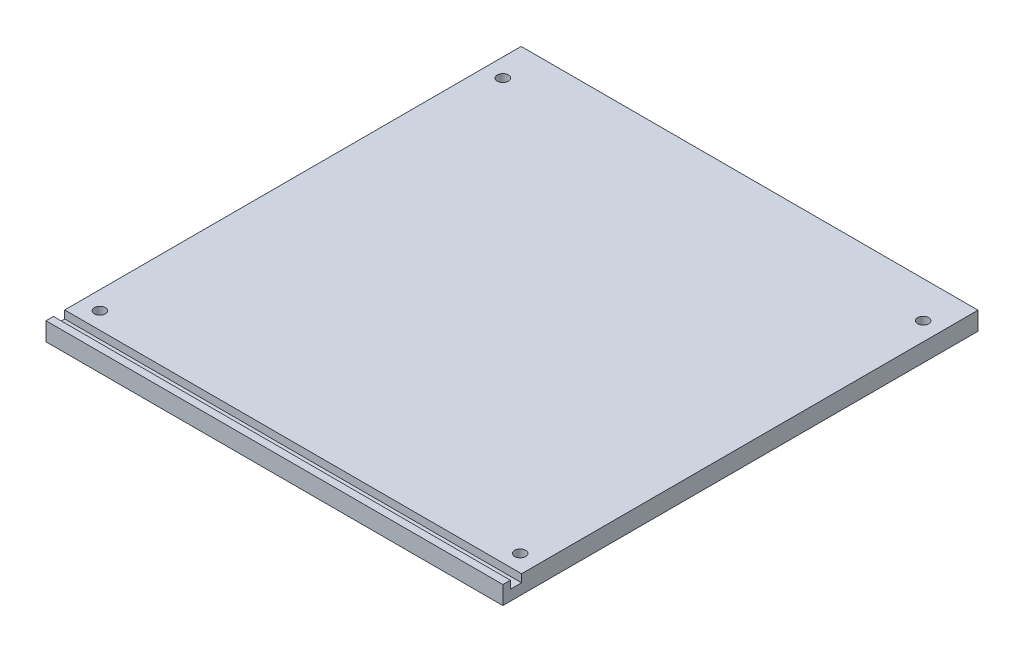
ISO-10303-21;
HEADER;
FILE_DESCRIPTION(('STEP AP214'),'2;1');
FILE_NAME('part.step','',(''),(''),'','','');
FILE_SCHEMA(('AUTOMOTIVE_DESIGN { 1 0 10303 214 1 1 1 1 }'));
ENDSEC;
DATA;
#1=APPLICATION_CONTEXT('core data for automotive mechanical design processes');
#2=APPLICATION_PROTOCOL_DEFINITION('international standard','automotive_design',2000,#1);
#3=PRODUCT_CONTEXT('',#1,'mechanical');
#4=PRODUCT('Part','Part','',(#3));
#5=PRODUCT_RELATED_PRODUCT_CATEGORY('part','',(#4));
#6=PRODUCT_DEFINITION_FORMATION('','',#4);
#7=PRODUCT_DEFINITION_CONTEXT('part definition',#1,'design');
#8=PRODUCT_DEFINITION('design','',#6,#7);
#9=PRODUCT_DEFINITION_SHAPE('','',#8);
#10=(LENGTH_UNIT() NAMED_UNIT(*) SI_UNIT(.MILLI.,.METRE.));
#11=(NAMED_UNIT(*) PLANE_ANGLE_UNIT() SI_UNIT($,.RADIAN.));
#12=(NAMED_UNIT(*) SI_UNIT($,.STERADIAN.) SOLID_ANGLE_UNIT());
#13=UNCERTAINTY_MEASURE_WITH_UNIT(LENGTH_MEASURE(1.E-05),#10,'distance_accuracy_value','');
#14=(GEOMETRIC_REPRESENTATION_CONTEXT(3) GLOBAL_UNCERTAINTY_ASSIGNED_CONTEXT((#13)) GLOBAL_UNIT_ASSIGNED_CONTEXT((#10,
#11,#12)) REPRESENTATION_CONTEXT('',''));
#15=CARTESIAN_POINT('',(0.,0.,0.));
#16=DIRECTION('',(0.,0.,1.));
#17=DIRECTION('',(1.,0.,0.));
#18=AXIS2_PLACEMENT_3D('',#15,#16,#17);
#19=CARTESIAN_POINT('',(0.,10.,0.));
#20=DIRECTION('',(0.,1.,0.));
#21=DIRECTION('',(0.,0.,1.));
#22=AXIS2_PLACEMENT_3D('',#19,#20,#21);
#23=PLANE('',#22);
#24=CARTESIAN_POINT('',(115.,10.,110.530243227503));
#25=DIRECTION('',(0.,1.,0.));
#26=DIRECTION('',(0.,0.,1.));
#27=AXIS2_PLACEMENT_3D('',#24,#25,#26);
#28=CIRCLE('',#27,2.99999999999999);
#29=CARTESIAN_POINT('',(115.,10.,113.530243227503));
#30=VERTEX_POINT('',#29);
#31=EDGE_CURVE('E288',#30,#30,#28,.F.);
#32=ORIENTED_EDGE('',*,*,#31,.T.);
#33=EDGE_LOOP('',(#32));
#34=FACE_BOUND('',#33,.T.);
#35=CARTESIAN_POINT('',(-114.999999999999,10.,-110.000000000002));
#36=DIRECTION('',(0.,1.,0.));
#37=DIRECTION('',(0.,0.,1.));
#38=AXIS2_PLACEMENT_3D('',#35,#36,#37);
#39=CIRCLE('',#38,3.00000000000001);
#40=CARTESIAN_POINT('',(-114.999999999999,10.,-107.000000000002));
#41=VERTEX_POINT('',#40);
#42=EDGE_CURVE('E303',#41,#41,#39,.F.);
#43=ORIENTED_EDGE('',*,*,#42,.T.);
#44=EDGE_LOOP('',(#43));
#45=FACE_BOUND('',#44,.T.);
#46=CARTESIAN_POINT('',(115.,10.,-110.000000000002));
#47=DIRECTION('',(0.,1.,0.));
#48=DIRECTION('',(0.,0.,1.));
#49=AXIS2_PLACEMENT_3D('',#46,#47,#48);
#50=CIRCLE('',#49,2.99999999999989);
#51=CARTESIAN_POINT('',(115.,10.,-107.000000000002));
#52=VERTEX_POINT('',#51);
#53=EDGE_CURVE('E298',#52,#52,#50,.F.);
#54=ORIENTED_EDGE('',*,*,#53,.T.);
#55=EDGE_LOOP('',(#54));
#56=FACE_BOUND('',#55,.T.);
#57=CARTESIAN_POINT('',(-115.,10.,110.530243227502));
#58=DIRECTION('',(0.,1.,0.));
#59=DIRECTION('',(0.,0.,1.));
#60=AXIS2_PLACEMENT_3D('',#57,#58,#59);
#61=CIRCLE('',#60,3.00000000000002);
#62=CARTESIAN_POINT('',(-115.,10.,113.530243227502));
#63=VERTEX_POINT('',#62);
#64=EDGE_CURVE('E292',#63,#63,#61,.F.);
#65=ORIENTED_EDGE('',*,*,#64,.T.);
#66=EDGE_LOOP('',(#65));
#67=FACE_BOUND('',#66,.T.);
#68=DIRECTION('',(-1.,0.,0.));
#69=VECTOR('',#68,1.);
#70=CARTESIAN_POINT('',(125.001,10.,119.782364442444));
#71=LINE('',#70,#69);
#72=CARTESIAN_POINT('',(125.,10.,119.782364442444));
#73=VERTEX_POINT('',#72);
#74=CARTESIAN_POINT('',(-125.,10.,119.782364442444));
#75=VERTEX_POINT('',#74);
#76=EDGE_CURVE('E127',#73,#75,#71,.T.);
#77=ORIENTED_EDGE('',*,*,#76,.F.);
#78=DIRECTION('',(0.,0.,-1.));
#79=VECTOR('',#78,1.);
#80=CARTESIAN_POINT('',(125.,10.,-130.));
#81=LINE('',#80,#79);
#82=CARTESIAN_POINT('',(125.,10.,-130.));
#83=VERTEX_POINT('',#82);
#84=EDGE_CURVE('E86',#73,#83,#81,.T.);
#85=ORIENTED_EDGE('',*,*,#84,.T.);
#86=DIRECTION('',(-1.,0.,0.));
#87=VECTOR('',#86,1.);
#88=CARTESIAN_POINT('',(-125.,10.,-130.));
#89=LINE('',#88,#87);
#90=CARTESIAN_POINT('',(-125.,10.,-130.));
#91=VERTEX_POINT('',#90);
#92=EDGE_CURVE('E146',#83,#91,#89,.T.);
#93=ORIENTED_EDGE('',*,*,#92,.T.);
#94=DIRECTION('',(0.,0.,1.));
#95=VECTOR('',#94,1.);
#96=CARTESIAN_POINT('',(-125.,10.,-130.));
#97=LINE('',#96,#95);
#98=EDGE_CURVE('E149',#91,#75,#97,.T.);
#99=ORIENTED_EDGE('',*,*,#98,.T.);
#100=EDGE_LOOP('',(#77,#85,#93,#99));
#101=FACE_BOUND('',#100,.T.);
#102=ADVANCED_FACE('F33',(#34,#45,#56,#67,#101),#23,.T.);
#103=CARTESIAN_POINT('',(125.,10.,-130.));
#104=DIRECTION('',(-1.,0.,0.));
#105=DIRECTION('',(0.,0.,1.));
#106=AXIS2_PLACEMENT_3D('',#103,#104,#105);
#107=PLANE('',#106);
#108=ORIENTED_EDGE('',*,*,#84,.F.);
#109=DIRECTION('',(0.,1.,0.));
#110=VECTOR('',#109,1.);
#111=CARTESIAN_POINT('',(125.,10.,119.782364442444));
#112=LINE('',#111,#110);
#113=CARTESIAN_POINT('',(125.,5.69896410413348,119.782364442444));
#114=VERTEX_POINT('',#113);
#115=EDGE_CURVE('E112',#114,#73,#112,.T.);
#116=ORIENTED_EDGE('',*,*,#115,.F.);
#117=DIRECTION('',(0.,0.,-1.));
#118=VECTOR('',#117,1.);
#119=CARTESIAN_POINT('',(125.,5.69896410413348,119.782364442444));
#120=LINE('',#119,#118);
#121=CARTESIAN_POINT('',(125.,5.69896410413348,125.920710135765));
#122=VERTEX_POINT('',#121);
#123=EDGE_CURVE('E121',#122,#114,#120,.T.);
#124=ORIENTED_EDGE('',*,*,#123,.F.);
#125=DIRECTION('',(0.,-1.,0.));
#126=VECTOR('',#125,1.);
#127=CARTESIAN_POINT('',(125.,10.,125.920710135765));
#128=LINE('',#127,#126);
#129=CARTESIAN_POINT('',(125.,10.,125.920710135765));
#130=VERTEX_POINT('',#129);
#131=EDGE_CURVE('E130',#130,#122,#128,.T.);
#132=ORIENTED_EDGE('',*,*,#131,.F.);
#133=CARTESIAN_POINT('',(125.,10.,130.));
#134=VERTEX_POINT('',#133);
#135=EDGE_CURVE('E144',#134,#130,#81,.T.);
#136=ORIENTED_EDGE('',*,*,#135,.F.);
#137=DIRECTION('',(0.,-1.,0.));
#138=VECTOR('',#137,1.);
#139=CARTESIAN_POINT('',(125.,10.,130.));
#140=LINE('',#139,#138);
#141=CARTESIAN_POINT('',(125.,0.,130.));
#142=VERTEX_POINT('',#141);
#143=EDGE_CURVE('E153',#134,#142,#140,.T.);
#144=ORIENTED_EDGE('',*,*,#143,.T.);
#145=DIRECTION('',(0.,0.,-1.));
#146=VECTOR('',#145,1.);
#147=CARTESIAN_POINT('',(125.,0.,-130.));
#148=LINE('',#147,#146);
#149=CARTESIAN_POINT('',(125.,0.,-130.));
#150=VERTEX_POINT('',#149);
#151=EDGE_CURVE('E126',#142,#150,#148,.T.);
#152=ORIENTED_EDGE('',*,*,#151,.T.);
#153=DIRECTION('',(0.,-1.,0.));
#154=VECTOR('',#153,1.);
#155=CARTESIAN_POINT('',(125.,10.,-130.));
#156=LINE('',#155,#154);
#157=EDGE_CURVE('E11',#83,#150,#156,.T.);
#158=ORIENTED_EDGE('',*,*,#157,.F.);
#159=EDGE_LOOP('',(#108,#116,#124,#132,#136,#144,#152,#158));
#160=FACE_BOUND('',#159,.T.);
#161=ADVANCED_FACE('F35',(#160),#107,.F.);
#162=CARTESIAN_POINT('',(-125.,10.,-130.));
#163=DIRECTION('',(0.,0.,1.));
#164=DIRECTION('',(1.,0.,0.));
#165=AXIS2_PLACEMENT_3D('',#162,#163,#164);
#166=PLANE('',#165);
#167=DIRECTION('',(-1.,0.,0.));
#168=VECTOR('',#167,1.);
#169=CARTESIAN_POINT('',(-125.,0.,-130.));
#170=LINE('',#169,#168);
#171=CARTESIAN_POINT('',(-125.,0.,-130.));
#172=VERTEX_POINT('',#171);
#173=EDGE_CURVE('E156',#150,#172,#170,.T.);
#174=ORIENTED_EDGE('',*,*,#173,.T.);
#175=DIRECTION('',(0.,-1.,0.));
#176=VECTOR('',#175,1.);
#177=CARTESIAN_POINT('',(-125.,10.,-130.));
#178=LINE('',#177,#176);
#179=EDGE_CURVE('E41',#91,#172,#178,.T.);
#180=ORIENTED_EDGE('',*,*,#179,.F.);
#181=ORIENTED_EDGE('',*,*,#92,.F.);
#182=ORIENTED_EDGE('',*,*,#157,.T.);
#183=EDGE_LOOP('',(#174,#180,#181,#182));
#184=FACE_BOUND('',#183,.T.);
#185=ADVANCED_FACE('F179',(#184),#166,.F.);
#186=CARTESIAN_POINT('',(-125.,10.,-130.));
#187=DIRECTION('',(1.,0.,0.));
#188=DIRECTION('',(0.,0.,-1.));
#189=AXIS2_PLACEMENT_3D('',#186,#187,#188);
#190=PLANE('',#189);
#191=DIRECTION('',(0.,0.,1.));
#192=VECTOR('',#191,1.);
#193=CARTESIAN_POINT('',(-125.,5.69896410413348,119.782364442444));
#194=LINE('',#193,#192);
#195=CARTESIAN_POINT('',(-125.,5.69896410413348,119.782364442444));
#196=VERTEX_POINT('',#195);
#197=CARTESIAN_POINT('',(-125.,5.69896410413348,125.920710135765));
#198=VERTEX_POINT('',#197);
#199=EDGE_CURVE('E132',#196,#198,#194,.T.);
#200=ORIENTED_EDGE('',*,*,#199,.F.);
#201=DIRECTION('',(0.,-1.,0.));
#202=VECTOR('',#201,1.);
#203=CARTESIAN_POINT('',(-125.,10.,119.782364442444));
#204=LINE('',#203,#202);
#205=EDGE_CURVE('E114',#75,#196,#204,.T.);
#206=ORIENTED_EDGE('',*,*,#205,.F.);
#207=ORIENTED_EDGE('',*,*,#98,.F.);
#208=ORIENTED_EDGE('',*,*,#179,.T.);
#209=DIRECTION('',(0.,0.,1.));
#210=VECTOR('',#209,1.);
#211=CARTESIAN_POINT('',(-125.,0.,-130.));
#212=LINE('',#211,#210);
#213=CARTESIAN_POINT('',(-125.,0.,130.));
#214=VERTEX_POINT('',#213);
#215=EDGE_CURVE('E158',#172,#214,#212,.T.);
#216=ORIENTED_EDGE('',*,*,#215,.T.);
#217=DIRECTION('',(0.,-1.,0.));
#218=VECTOR('',#217,1.);
#219=CARTESIAN_POINT('',(-125.,10.,130.));
#220=LINE('',#219,#218);
#221=CARTESIAN_POINT('',(-125.,10.,130.));
#222=VERTEX_POINT('',#221);
#223=EDGE_CURVE('E162',#222,#214,#220,.T.);
#224=ORIENTED_EDGE('',*,*,#223,.F.);
#225=CARTESIAN_POINT('',(-125.,10.,125.920710135765));
#226=VERTEX_POINT('',#225);
#227=EDGE_CURVE('E148',#226,#222,#97,.T.);
#228=ORIENTED_EDGE('',*,*,#227,.F.);
#229=DIRECTION('',(0.,1.,0.));
#230=VECTOR('',#229,1.);
#231=CARTESIAN_POINT('',(-125.,10.,125.920710135765));
#232=LINE('',#231,#230);
#233=EDGE_CURVE('E48',#198,#226,#232,.T.);
#234=ORIENTED_EDGE('',*,*,#233,.F.);
#235=EDGE_LOOP('',(#200,#206,#207,#208,#216,#224,#228,#234));
#236=FACE_BOUND('',#235,.T.);
#237=ADVANCED_FACE('F168',(#236),#190,.F.);
#238=CARTESIAN_POINT('',(-125.,10.,130.));
#239=DIRECTION('',(0.,0.,-1.));
#240=DIRECTION('',(-1.,0.,0.));
#241=AXIS2_PLACEMENT_3D('',#238,#239,#240);
#242=PLANE('',#241);
#243=DIRECTION('',(1.,0.,0.));
#244=VECTOR('',#243,1.);
#245=CARTESIAN_POINT('',(-125.,0.,130.));
#246=LINE('',#245,#244);
#247=EDGE_CURVE('E78',#214,#142,#246,.T.);
#248=ORIENTED_EDGE('',*,*,#247,.T.);
#249=ORIENTED_EDGE('',*,*,#143,.F.);
#250=DIRECTION('',(1.,0.,0.));
#251=VECTOR('',#250,1.);
#252=CARTESIAN_POINT('',(-125.,10.,130.));
#253=LINE('',#252,#251);
#254=EDGE_CURVE('E57',#222,#134,#253,.T.);
#255=ORIENTED_EDGE('',*,*,#254,.F.);
#256=ORIENTED_EDGE('',*,*,#223,.T.);
#257=EDGE_LOOP('',(#248,#249,#255,#256));
#258=FACE_BOUND('',#257,.T.);
#259=ADVANCED_FACE('F175',(#258),#242,.F.);
#260=DIRECTION('',(-1.,0.,0.));
#261=VECTOR('',#260,1.);
#262=CARTESIAN_POINT('',(125.001,10.,125.920710135765));
#263=LINE('',#262,#261);
#264=EDGE_CURVE('E141',#130,#226,#263,.T.);
#265=ORIENTED_EDGE('',*,*,#264,.T.);
#266=ORIENTED_EDGE('',*,*,#227,.T.);
#267=ORIENTED_EDGE('',*,*,#254,.T.);
#268=ORIENTED_EDGE('',*,*,#135,.T.);
#269=EDGE_LOOP('',(#265,#266,#267,#268));
#270=FACE_BOUND('',#269,.T.);
#271=ADVANCED_FACE('F177',(#270),#23,.T.);
#272=CARTESIAN_POINT('',(0.,0.,0.));
#273=DIRECTION('',(0.,1.,0.));
#274=DIRECTION('',(0.,0.,1.));
#275=AXIS2_PLACEMENT_3D('',#272,#273,#274);
#276=PLANE('',#275);
#277=CARTESIAN_POINT('',(115.,0.,110.530243227503));
#278=DIRECTION('',(0.,-1.,0.));
#279=DIRECTION('',(0.,0.,-1.));
#280=AXIS2_PLACEMENT_3D('',#277,#278,#279);
#281=CIRCLE('',#280,2.99999999999999);
#282=CARTESIAN_POINT('',(115.,0.,107.530243227503));
#283=VERTEX_POINT('',#282);
#284=EDGE_CURVE('E291',#283,#283,#281,.T.);
#285=ORIENTED_EDGE('',*,*,#284,.F.);
#286=EDGE_LOOP('',(#285));
#287=FACE_BOUND('',#286,.T.);
#288=CARTESIAN_POINT('',(-114.999999999999,0.,-110.000000000002));
#289=DIRECTION('',(0.,-1.,0.));
#290=DIRECTION('',(0.,0.,-1.));
#291=AXIS2_PLACEMENT_3D('',#288,#289,#290);
#292=CIRCLE('',#291,3.00000000000001);
#293=CARTESIAN_POINT('',(-114.999999999999,0.,-113.000000000002));
#294=VERTEX_POINT('',#293);
#295=EDGE_CURVE('E295',#294,#294,#292,.T.);
#296=ORIENTED_EDGE('',*,*,#295,.F.);
#297=EDGE_LOOP('',(#296));
#298=FACE_BOUND('',#297,.T.);
#299=CARTESIAN_POINT('',(115.,0.,-110.000000000002));
#300=DIRECTION('',(0.,-1.,0.));
#301=DIRECTION('',(0.,0.,-1.));
#302=AXIS2_PLACEMENT_3D('',#299,#300,#301);
#303=CIRCLE('',#302,2.99999999999989);
#304=CARTESIAN_POINT('',(115.,0.,-113.000000000001));
#305=VERTEX_POINT('',#304);
#306=EDGE_CURVE('E306',#305,#305,#303,.T.);
#307=ORIENTED_EDGE('',*,*,#306,.F.);
#308=EDGE_LOOP('',(#307));
#309=FACE_BOUND('',#308,.T.);
#310=CARTESIAN_POINT('',(-115.,0.,110.530243227502));
#311=DIRECTION('',(0.,-1.,0.));
#312=DIRECTION('',(0.,0.,-1.));
#313=AXIS2_PLACEMENT_3D('',#310,#311,#312);
#314=CIRCLE('',#313,3.00000000000002);
#315=CARTESIAN_POINT('',(-115.,0.,107.530243227502));
#316=VERTEX_POINT('',#315);
#317=EDGE_CURVE('E134',#316,#316,#314,.T.);
#318=ORIENTED_EDGE('',*,*,#317,.F.);
#319=EDGE_LOOP('',(#318));
#320=FACE_BOUND('',#319,.T.);
#321=ORIENTED_EDGE('',*,*,#151,.F.);
#322=ORIENTED_EDGE('',*,*,#247,.F.);
#323=ORIENTED_EDGE('',*,*,#215,.F.);
#324=ORIENTED_EDGE('',*,*,#173,.F.);
#325=EDGE_LOOP('',(#321,#322,#323,#324));
#326=FACE_BOUND('',#325,.T.);
#327=ADVANCED_FACE('F173',(#287,#298,#309,#320,#326),#276,.F.);
#328=CARTESIAN_POINT('',(125.001,10.,119.782364442444));
#329=DIRECTION('',(0.,0.,-1.));
#330=DIRECTION('',(-1.,0.,0.));
#331=AXIS2_PLACEMENT_3D('',#328,#329,#330);
#332=PLANE('',#331);
#333=ORIENTED_EDGE('',*,*,#115,.T.);
#334=ORIENTED_EDGE('',*,*,#76,.T.);
#335=ORIENTED_EDGE('',*,*,#205,.T.);
#336=DIRECTION('',(-1.,0.,0.));
#337=VECTOR('',#336,1.);
#338=CARTESIAN_POINT('',(125.001,5.69896410413348,119.782364442444));
#339=LINE('',#338,#337);
#340=EDGE_CURVE('E108',#114,#196,#339,.T.);
#341=ORIENTED_EDGE('',*,*,#340,.F.);
#342=EDGE_LOOP('',(#333,#334,#335,#341));
#343=FACE_BOUND('',#342,.T.);
#344=ADVANCED_FACE('F110',(#343),#332,.F.);
#345=CARTESIAN_POINT('',(125.001,10.,125.920710135765));
#346=DIRECTION('',(0.,0.,1.));
#347=DIRECTION('',(1.,0.,0.));
#348=AXIS2_PLACEMENT_3D('',#345,#346,#347);
#349=PLANE('',#348);
#350=ORIENTED_EDGE('',*,*,#131,.T.);
#351=DIRECTION('',(-1.,0.,0.));
#352=VECTOR('',#351,1.);
#353=CARTESIAN_POINT('',(125.001,5.69896410413348,125.920710135765));
#354=LINE('',#353,#352);
#355=EDGE_CURVE('E118',#122,#198,#354,.T.);
#356=ORIENTED_EDGE('',*,*,#355,.T.);
#357=ORIENTED_EDGE('',*,*,#233,.T.);
#358=ORIENTED_EDGE('',*,*,#264,.F.);
#359=EDGE_LOOP('',(#350,#356,#357,#358));
#360=FACE_BOUND('',#359,.T.);
#361=ADVANCED_FACE('F178',(#360),#349,.F.);
#362=CARTESIAN_POINT('',(125.001,5.69896410413348,119.782364442444));
#363=DIRECTION('',(0.,-1.,0.));
#364=DIRECTION('',(0.,0.,-1.));
#365=AXIS2_PLACEMENT_3D('',#362,#363,#364);
#366=PLANE('',#365);
#367=ORIENTED_EDGE('',*,*,#123,.T.);
#368=ORIENTED_EDGE('',*,*,#340,.T.);
#369=ORIENTED_EDGE('',*,*,#199,.T.);
#370=ORIENTED_EDGE('',*,*,#355,.F.);
#371=EDGE_LOOP('',(#367,#368,#369,#370));
#372=FACE_BOUND('',#371,.T.);
#373=ADVANCED_FACE('F122',(#372),#366,.F.);
#374=CARTESIAN_POINT('',(-115.,10.001,110.530243227502));
#375=DIRECTION('',(0.,-1.,0.));
#376=DIRECTION('',(0.,0.,-1.));
#377=AXIS2_PLACEMENT_3D('',#374,#375,#376);
#378=CYLINDRICAL_SURFACE('',#377,3.00000000000002);
#379=ORIENTED_EDGE('',*,*,#64,.F.);
#380=EDGE_LOOP('',(#379));
#381=FACE_BOUND('',#380,.T.);
#382=ORIENTED_EDGE('',*,*,#317,.T.);
#383=EDGE_LOOP('',(#382));
#384=FACE_BOUND('',#383,.T.);
#385=ADVANCED_FACE('F242',(#381,#384),#378,.F.);
#386=CARTESIAN_POINT('',(115.,10.001,-110.000000000002));
#387=DIRECTION('',(0.,-1.,0.));
#388=DIRECTION('',(0.,0.,-1.));
#389=AXIS2_PLACEMENT_3D('',#386,#387,#388);
#390=CYLINDRICAL_SURFACE('',#389,2.99999999999989);
#391=ORIENTED_EDGE('',*,*,#53,.F.);
#392=EDGE_LOOP('',(#391));
#393=FACE_BOUND('',#392,.T.);
#394=ORIENTED_EDGE('',*,*,#306,.T.);
#395=EDGE_LOOP('',(#394));
#396=FACE_BOUND('',#395,.T.);
#397=ADVANCED_FACE('F252',(#393,#396),#390,.F.);
#398=CARTESIAN_POINT('',(-114.999999999999,10.001,-110.000000000002));
#399=DIRECTION('',(0.,-1.,0.));
#400=DIRECTION('',(0.,0.,-1.));
#401=AXIS2_PLACEMENT_3D('',#398,#399,#400);
#402=CYLINDRICAL_SURFACE('',#401,3.00000000000001);
#403=ORIENTED_EDGE('',*,*,#42,.F.);
#404=EDGE_LOOP('',(#403));
#405=FACE_BOUND('',#404,.T.);
#406=ORIENTED_EDGE('',*,*,#295,.T.);
#407=EDGE_LOOP('',(#406));
#408=FACE_BOUND('',#407,.T.);
#409=ADVANCED_FACE('F259',(#405,#408),#402,.F.);
#410=CARTESIAN_POINT('',(115.,10.001,110.530243227503));
#411=DIRECTION('',(0.,-1.,0.));
#412=DIRECTION('',(0.,0.,-1.));
#413=AXIS2_PLACEMENT_3D('',#410,#411,#412);
#414=CYLINDRICAL_SURFACE('',#413,2.99999999999999);
#415=ORIENTED_EDGE('',*,*,#31,.F.);
#416=EDGE_LOOP('',(#415));
#417=FACE_BOUND('',#416,.T.);
#418=ORIENTED_EDGE('',*,*,#284,.T.);
#419=EDGE_LOOP('',(#418));
#420=FACE_BOUND('',#419,.T.);
#421=ADVANCED_FACE('F267',(#417,#420),#414,.F.);
#422=CLOSED_SHELL('',(#102,#161,#185,#237,#259,#271,#327,#344,#361,#373,#385,#397,#409,#421));
#423=MANIFOLD_SOLID_BREP('B2',#422);
#424=ADVANCED_BREP_SHAPE_REPRESENTATION('',(#18,#423),#14);
#425=SHAPE_DEFINITION_REPRESENTATION(#9,#424);
ENDSEC;
END-ISO-10303-21;
